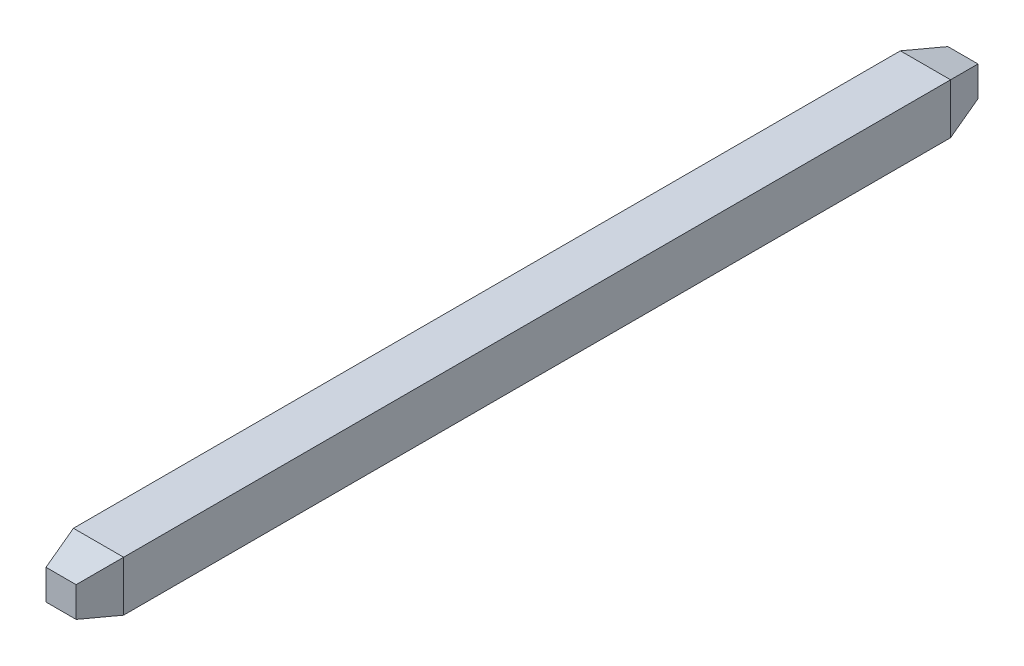
ISO-10303-21;
HEADER;
FILE_DESCRIPTION(('STEP AP214'),'2;1');
FILE_NAME('part.step','',(''),(''),'','','');
FILE_SCHEMA(('AUTOMOTIVE_DESIGN { 1 0 10303 214 1 1 1 1 }'));
ENDSEC;
DATA;
#1=APPLICATION_CONTEXT('core data for automotive mechanical design processes');
#2=APPLICATION_PROTOCOL_DEFINITION('international standard','automotive_design',2000,#1);
#3=PRODUCT_CONTEXT('',#1,'mechanical');
#4=PRODUCT('Part','Part','',(#3));
#5=PRODUCT_RELATED_PRODUCT_CATEGORY('part','',(#4));
#6=PRODUCT_DEFINITION_FORMATION('','',#4);
#7=PRODUCT_DEFINITION_CONTEXT('part definition',#1,'design');
#8=PRODUCT_DEFINITION('design','',#6,#7);
#9=PRODUCT_DEFINITION_SHAPE('','',#8);
#10=(LENGTH_UNIT() NAMED_UNIT(*) SI_UNIT(.MILLI.,.METRE.));
#11=(NAMED_UNIT(*) PLANE_ANGLE_UNIT() SI_UNIT($,.RADIAN.));
#12=(NAMED_UNIT(*) SI_UNIT($,.STERADIAN.) SOLID_ANGLE_UNIT());
#13=UNCERTAINTY_MEASURE_WITH_UNIT(LENGTH_MEASURE(1.E-05),#10,'distance_accuracy_value','');
#14=(GEOMETRIC_REPRESENTATION_CONTEXT(3) GLOBAL_UNCERTAINTY_ASSIGNED_CONTEXT((#13)) GLOBAL_UNIT_ASSIGNED_CONTEXT((#10,
#11,#12)) REPRESENTATION_CONTEXT('',''));
#15=CARTESIAN_POINT('',(0.,0.,0.));
#16=DIRECTION('',(0.,0.,1.));
#17=DIRECTION('',(1.,0.,0.));
#18=AXIS2_PLACEMENT_3D('',#15,#16,#17);
#19=CARTESIAN_POINT('',(3.54859499326237,-0.320000000000075,7.92229749663118));
#20=DIRECTION('',(0.,-0.965925826289069,0.25881904510252));
#21=DIRECTION('',(0.,-0.25881904510252,-0.965925826289069));
#22=AXIS2_PLACEMENT_3D('',#19,#20,#21);
#23=PLANE('',#22);
#24=DIRECTION('',(1.,0.,0.));
#25=VECTOR('',#24,1.);
#26=CARTESIAN_POINT('',(5.08,-0.192000000000075,8.4));
#27=LINE('',#26,#25);
#28=CARTESIAN_POINT('',(4.888,-0.192000000000074,8.4));
#29=VERTEX_POINT('',#28);
#30=CARTESIAN_POINT('',(5.272,-0.192000000000074,8.4));
#31=VERTEX_POINT('',#30);
#32=EDGE_CURVE('E20',#29,#31,#27,.T.);
#33=ORIENTED_EDGE('',*,*,#32,.F.);
#34=DIRECTION('',(0.250562807085731,0.25056280708573,0.93511312653103));
#35=VECTOR('',#34,1.);
#36=CARTESIAN_POINT('',(4.76,-0.320000000000075,7.92229749663118));
#37=LINE('',#36,#35);
#38=CARTESIAN_POINT('',(4.76,-0.320000000000075,7.92229749663118));
#39=VERTEX_POINT('',#38);
#40=EDGE_CURVE('E110',#39,#29,#37,.T.);
#41=ORIENTED_EDGE('',*,*,#40,.F.);
#42=DIRECTION('',(1.,0.,0.));
#43=VECTOR('',#42,1.);
#44=CARTESIAN_POINT('',(4.76,-0.320000000000075,7.92229749663118));
#45=LINE('',#44,#43);
#46=CARTESIAN_POINT('',(5.4,-0.320000000000074,7.92229749663118));
#47=VERTEX_POINT('',#46);
#48=EDGE_CURVE('E96',#47,#39,#45,.F.);
#49=ORIENTED_EDGE('',*,*,#48,.F.);
#50=DIRECTION('',(0.250562807085732,-0.250562807085729,-0.93511312653103));
#51=VECTOR('',#50,1.);
#52=CARTESIAN_POINT('',(5.272,-0.192000000000074,8.4));
#53=LINE('',#52,#51);
#54=EDGE_CURVE('E94',#31,#47,#53,.T.);
#55=ORIENTED_EDGE('',*,*,#54,.F.);
#56=EDGE_LOOP('',(#33,#41,#49,#55));
#57=FACE_BOUND('',#56,.T.);
#58=ADVANCED_FACE('F17',(#57),#23,.T.);
#59=CARTESIAN_POINT('',(3.54859499326237,-0.320000000000075,-2.62229749663118));
#60=DIRECTION('',(0.,0.965925826289068,0.258819045102521));
#61=DIRECTION('',(0.,-0.258819045102521,0.965925826289068));
#62=AXIS2_PLACEMENT_3D('',#59,#60,#61);
#63=PLANE('',#62);
#64=DIRECTION('',(0.250562807085732,0.25056280708573,-0.93511312653103));
#65=VECTOR('',#64,1.);
#66=CARTESIAN_POINT('',(4.76,-0.320000000000075,-2.62229749663118));
#67=LINE('',#66,#65);
#68=CARTESIAN_POINT('',(4.76,-0.320000000000075,-2.62229749663118));
#69=VERTEX_POINT('',#68);
#70=CARTESIAN_POINT('',(4.888,-0.192000000000074,-3.1));
#71=VERTEX_POINT('',#70);
#72=EDGE_CURVE('E113',#69,#71,#67,.T.);
#73=ORIENTED_EDGE('',*,*,#72,.T.);
#74=DIRECTION('',(1.,0.,0.));
#75=VECTOR('',#74,1.);
#76=CARTESIAN_POINT('',(5.08,-0.192000000000075,-3.1));
#77=LINE('',#76,#75);
#78=CARTESIAN_POINT('',(5.272,-0.192000000000074,-3.1));
#79=VERTEX_POINT('',#78);
#80=EDGE_CURVE('E79',#71,#79,#77,.T.);
#81=ORIENTED_EDGE('',*,*,#80,.T.);
#82=DIRECTION('',(0.250562807085734,-0.250562807085729,0.935113126531029));
#83=VECTOR('',#82,1.);
#84=CARTESIAN_POINT('',(5.272,-0.192000000000074,-3.1));
#85=LINE('',#84,#83);
#86=CARTESIAN_POINT('',(5.4,-0.320000000000074,-2.62229749663118));
#87=VERTEX_POINT('',#86);
#88=EDGE_CURVE('E108',#79,#87,#85,.T.);
#89=ORIENTED_EDGE('',*,*,#88,.T.);
#90=DIRECTION('',(1.,0.,0.));
#91=VECTOR('',#90,1.);
#92=CARTESIAN_POINT('',(4.76,-0.320000000000075,-2.62229749663118));
#93=LINE('',#92,#91);
#94=EDGE_CURVE('E118',#69,#87,#93,.T.);
#95=ORIENTED_EDGE('',*,*,#94,.F.);
#96=EDGE_LOOP('',(#73,#81,#89,#95));
#97=FACE_BOUND('',#96,.T.);
#98=ADVANCED_FACE('F281',(#97),#63,.F.);
#99=CARTESIAN_POINT('',(5.08,0.,8.4));
#100=DIRECTION('',(0.,0.,1.));
#101=DIRECTION('',(1.,0.,0.));
#102=AXIS2_PLACEMENT_3D('',#99,#100,#101);
#103=PLANE('',#102);
#104=ORIENTED_EDGE('',*,*,#32,.T.);
#105=DIRECTION('',(0.,1.,0.));
#106=VECTOR('',#105,1.);
#107=CARTESIAN_POINT('',(5.272,-1.5314050067377,8.4));
#108=LINE('',#107,#106);
#109=CARTESIAN_POINT('',(5.272,0.191999999999926,8.4));
#110=VERTEX_POINT('',#109);
#111=EDGE_CURVE('E88',#110,#31,#108,.F.);
#112=ORIENTED_EDGE('',*,*,#111,.F.);
#113=DIRECTION('',(1.,0.,0.));
#114=VECTOR('',#113,1.);
#115=CARTESIAN_POINT('',(6.61140500673763,0.191999999999924,8.4));
#116=LINE('',#115,#114);
#117=CARTESIAN_POINT('',(4.888,0.191999999999925,8.4));
#118=VERTEX_POINT('',#117);
#119=EDGE_CURVE('E124',#118,#110,#116,.T.);
#120=ORIENTED_EDGE('',*,*,#119,.F.);
#121=DIRECTION('',(0.,1.,0.));
#122=VECTOR('',#121,1.);
#123=CARTESIAN_POINT('',(4.888,1.53140500673756,8.4));
#124=LINE('',#123,#122);
#125=EDGE_CURVE('E90',#29,#118,#124,.T.);
#126=ORIENTED_EDGE('',*,*,#125,.F.);
#127=EDGE_LOOP('',(#104,#112,#120,#126));
#128=FACE_BOUND('',#127,.T.);
#129=ADVANCED_FACE('F85',(#128),#103,.T.);
#130=CARTESIAN_POINT('',(5.4,-1.5314050067377,7.92229749663118));
#131=DIRECTION('',(0.965925826289069,0.,0.25881904510252));
#132=DIRECTION('',(0.25881904510252,0.,-0.965925826289069));
#133=AXIS2_PLACEMENT_3D('',#130,#131,#132);
#134=PLANE('',#133);
#135=ORIENTED_EDGE('',*,*,#111,.T.);
#136=ORIENTED_EDGE('',*,*,#54,.T.);
#137=DIRECTION('',(0.,1.,0.));
#138=VECTOR('',#137,1.);
#139=CARTESIAN_POINT('',(5.4,-0.320000000000074,7.92229749663118));
#140=LINE('',#139,#138);
#141=CARTESIAN_POINT('',(5.4,0.319999999999925,7.92229749663118));
#142=VERTEX_POINT('',#141);
#143=EDGE_CURVE('E127',#142,#47,#140,.F.);
#144=ORIENTED_EDGE('',*,*,#143,.F.);
#145=DIRECTION('',(0.250562807085729,0.250562807085731,-0.93511312653103));
#146=VECTOR('',#145,1.);
#147=CARTESIAN_POINT('',(5.272,0.191999999999925,8.4));
#148=LINE('',#147,#146);
#149=EDGE_CURVE('E102',#110,#142,#148,.T.);
#150=ORIENTED_EDGE('',*,*,#149,.F.);
#151=EDGE_LOOP('',(#135,#136,#144,#150));
#152=FACE_BOUND('',#151,.T.);
#153=ADVANCED_FACE('F100',(#152),#134,.T.);
#154=CARTESIAN_POINT('',(5.08,0.,-3.1));
#155=DIRECTION('',(0.,0.,1.));
#156=DIRECTION('',(1.,0.,0.));
#157=AXIS2_PLACEMENT_3D('',#154,#155,#156);
#158=PLANE('',#157);
#159=DIRECTION('',(0.,1.,0.));
#160=VECTOR('',#159,1.);
#161=CARTESIAN_POINT('',(5.272,-1.5314050067377,-3.1));
#162=LINE('',#161,#160);
#163=CARTESIAN_POINT('',(5.272,0.191999999999926,-3.1));
#164=VERTEX_POINT('',#163);
#165=EDGE_CURVE('E106',#164,#79,#162,.F.);
#166=ORIENTED_EDGE('',*,*,#165,.T.);
#167=ORIENTED_EDGE('',*,*,#80,.F.);
#168=DIRECTION('',(0.,1.,0.));
#169=VECTOR('',#168,1.);
#170=CARTESIAN_POINT('',(4.888,1.53140500673756,-3.1));
#171=LINE('',#170,#169);
#172=CARTESIAN_POINT('',(4.888,0.191999999999925,-3.1));
#173=VERTEX_POINT('',#172);
#174=EDGE_CURVE('E115',#71,#173,#171,.T.);
#175=ORIENTED_EDGE('',*,*,#174,.T.);
#176=DIRECTION('',(1.,0.,0.));
#177=VECTOR('',#176,1.);
#178=CARTESIAN_POINT('',(6.61140500673763,0.191999999999924,-3.1));
#179=LINE('',#178,#177);
#180=EDGE_CURVE('E138',#173,#164,#179,.T.);
#181=ORIENTED_EDGE('',*,*,#180,.T.);
#182=EDGE_LOOP('',(#166,#167,#175,#181));
#183=FACE_BOUND('',#182,.T.);
#184=ADVANCED_FACE('F257',(#183),#158,.F.);
#185=CARTESIAN_POINT('',(5.4,-1.5314050067377,-2.62229749663118));
#186=DIRECTION('',(-0.965925826289068,0.,0.258819045102521));
#187=DIRECTION('',(0.258819045102521,0.,0.965925826289068));
#188=AXIS2_PLACEMENT_3D('',#185,#186,#187);
#189=PLANE('',#188);
#190=ORIENTED_EDGE('',*,*,#88,.F.);
#191=ORIENTED_EDGE('',*,*,#165,.F.);
#192=DIRECTION('',(0.250562807085729,0.250562807085732,0.93511312653103));
#193=VECTOR('',#192,1.);
#194=CARTESIAN_POINT('',(5.272,0.191999999999924,-3.1));
#195=LINE('',#194,#193);
#196=CARTESIAN_POINT('',(5.4,0.319999999999925,-2.62229749663118));
#197=VERTEX_POINT('',#196);
#198=EDGE_CURVE('E140',#164,#197,#195,.T.);
#199=ORIENTED_EDGE('',*,*,#198,.T.);
#200=DIRECTION('',(0.,1.,0.));
#201=VECTOR('',#200,1.);
#202=CARTESIAN_POINT('',(5.4,-0.320000000000074,-2.62229749663118));
#203=LINE('',#202,#201);
#204=EDGE_CURVE('E133',#87,#197,#203,.T.);
#205=ORIENTED_EDGE('',*,*,#204,.F.);
#206=EDGE_LOOP('',(#190,#191,#199,#205));
#207=FACE_BOUND('',#206,.T.);
#208=ADVANCED_FACE('F249',(#207),#189,.F.);
#209=CARTESIAN_POINT('',(4.76,1.53140500673756,7.92229749663118));
#210=DIRECTION('',(-0.965925826289069,0.,0.25881904510252));
#211=DIRECTION('',(0.25881904510252,0.,0.965925826289069));
#212=AXIS2_PLACEMENT_3D('',#209,#210,#211);
#213=PLANE('',#212);
#214=ORIENTED_EDGE('',*,*,#125,.T.);
#215=DIRECTION('',(0.25056280708573,-0.250562807085731,0.93511312653103));
#216=VECTOR('',#215,1.);
#217=CARTESIAN_POINT('',(4.76,0.319999999999926,7.92229749663118));
#218=LINE('',#217,#216);
#219=CARTESIAN_POINT('',(4.76,0.319999999999925,7.92229749663118));
#220=VERTEX_POINT('',#219);
#221=EDGE_CURVE('E121',#220,#118,#218,.T.);
#222=ORIENTED_EDGE('',*,*,#221,.F.);
#223=DIRECTION('',(0.,-1.,0.));
#224=VECTOR('',#223,1.);
#225=CARTESIAN_POINT('',(4.76,0.319999999999926,7.92229749663118));
#226=LINE('',#225,#224);
#227=EDGE_CURVE('E142',#39,#220,#226,.F.);
#228=ORIENTED_EDGE('',*,*,#227,.F.);
#229=ORIENTED_EDGE('',*,*,#40,.T.);
#230=EDGE_LOOP('',(#214,#222,#228,#229));
#231=FACE_BOUND('',#230,.T.);
#232=ADVANCED_FACE('F171',(#231),#213,.T.);
#233=CARTESIAN_POINT('',(4.76,1.53140500673756,-2.62229749663118));
#234=DIRECTION('',(0.965925826289068,0.,0.258819045102521));
#235=DIRECTION('',(0.258819045102521,0.,-0.965925826289068));
#236=AXIS2_PLACEMENT_3D('',#233,#234,#235);
#237=PLANE('',#236);
#238=DIRECTION('',(0.25056280708573,-0.250562807085732,-0.93511312653103));
#239=VECTOR('',#238,1.);
#240=CARTESIAN_POINT('',(4.76,0.319999999999926,-2.62229749663118));
#241=LINE('',#240,#239);
#242=CARTESIAN_POINT('',(4.76,0.319999999999926,-2.62229749663118));
#243=VERTEX_POINT('',#242);
#244=EDGE_CURVE('E136',#243,#173,#241,.T.);
#245=ORIENTED_EDGE('',*,*,#244,.T.);
#246=ORIENTED_EDGE('',*,*,#174,.F.);
#247=ORIENTED_EDGE('',*,*,#72,.F.);
#248=DIRECTION('',(0.,-1.,0.));
#249=VECTOR('',#248,1.);
#250=CARTESIAN_POINT('',(4.76,0.319999999999926,-2.62229749663118));
#251=LINE('',#250,#249);
#252=EDGE_CURVE('E35',#243,#69,#251,.T.);
#253=ORIENTED_EDGE('',*,*,#252,.F.);
#254=EDGE_LOOP('',(#245,#246,#247,#253));
#255=FACE_BOUND('',#254,.T.);
#256=ADVANCED_FACE('F188',(#255),#237,.F.);
#257=CARTESIAN_POINT('',(4.76,-0.320000000000075,-3.1));
#258=DIRECTION('',(0.,-1.,0.));
#259=DIRECTION('',(1.,0.,0.));
#260=AXIS2_PLACEMENT_3D('',#257,#258,#259);
#261=PLANE('',#260);
#262=ORIENTED_EDGE('',*,*,#94,.T.);
#263=DIRECTION('',(0.,0.,1.));
#264=VECTOR('',#263,1.);
#265=CARTESIAN_POINT('',(5.4,-0.320000000000074,-3.1));
#266=LINE('',#265,#264);
#267=EDGE_CURVE('E130',#47,#87,#266,.F.);
#268=ORIENTED_EDGE('',*,*,#267,.F.);
#269=ORIENTED_EDGE('',*,*,#48,.T.);
#270=DIRECTION('',(0.,0.,1.));
#271=VECTOR('',#270,1.);
#272=CARTESIAN_POINT('',(4.76,-0.320000000000075,-3.1));
#273=LINE('',#272,#271);
#274=EDGE_CURVE('E146',#69,#39,#273,.T.);
#275=ORIENTED_EDGE('',*,*,#274,.F.);
#276=EDGE_LOOP('',(#262,#268,#269,#275));
#277=FACE_BOUND('',#276,.T.);
#278=ADVANCED_FACE('F174',(#277),#261,.T.);
#279=CARTESIAN_POINT('',(6.61140500673763,0.319999999999925,7.92229749663118));
#280=DIRECTION('',(0.,0.965925826289069,0.25881904510252));
#281=DIRECTION('',(0.,-0.25881904510252,0.965925826289069));
#282=AXIS2_PLACEMENT_3D('',#279,#280,#281);
#283=PLANE('',#282);
#284=ORIENTED_EDGE('',*,*,#119,.T.);
#285=ORIENTED_EDGE('',*,*,#149,.T.);
#286=DIRECTION('',(-1.,0.,0.));
#287=VECTOR('',#286,1.);
#288=CARTESIAN_POINT('',(5.4,0.319999999999925,7.92229749663118));
#289=LINE('',#288,#287);
#290=EDGE_CURVE('E149',#220,#142,#289,.F.);
#291=ORIENTED_EDGE('',*,*,#290,.F.);
#292=ORIENTED_EDGE('',*,*,#221,.T.);
#293=EDGE_LOOP('',(#284,#285,#291,#292));
#294=FACE_BOUND('',#293,.T.);
#295=ADVANCED_FACE('F179',(#294),#283,.T.);
#296=CARTESIAN_POINT('',(5.4,-0.320000000000074,-3.1));
#297=DIRECTION('',(1.,0.,0.));
#298=DIRECTION('',(0.,1.,0.));
#299=AXIS2_PLACEMENT_3D('',#296,#297,#298);
#300=PLANE('',#299);
#301=ORIENTED_EDGE('',*,*,#204,.T.);
#302=DIRECTION('',(0.,0.,1.));
#303=VECTOR('',#302,1.);
#304=CARTESIAN_POINT('',(5.4,0.319999999999925,-3.1));
#305=LINE('',#304,#303);
#306=EDGE_CURVE('E152',#142,#197,#305,.F.);
#307=ORIENTED_EDGE('',*,*,#306,.F.);
#308=ORIENTED_EDGE('',*,*,#143,.T.);
#309=ORIENTED_EDGE('',*,*,#267,.T.);
#310=EDGE_LOOP('',(#301,#307,#308,#309));
#311=FACE_BOUND('',#310,.T.);
#312=ADVANCED_FACE('F177',(#311),#300,.T.);
#313=CARTESIAN_POINT('',(6.61140500673763,0.319999999999925,-2.62229749663118));
#314=DIRECTION('',(0.,-0.965925826289068,0.258819045102521));
#315=DIRECTION('',(0.,-0.258819045102521,-0.965925826289068));
#316=AXIS2_PLACEMENT_3D('',#313,#314,#315);
#317=PLANE('',#316);
#318=ORIENTED_EDGE('',*,*,#198,.F.);
#319=ORIENTED_EDGE('',*,*,#180,.F.);
#320=ORIENTED_EDGE('',*,*,#244,.F.);
#321=DIRECTION('',(-1.,0.,0.));
#322=VECTOR('',#321,1.);
#323=CARTESIAN_POINT('',(5.4,0.319999999999925,-2.62229749663118));
#324=LINE('',#323,#322);
#325=EDGE_CURVE('E26',#197,#243,#324,.T.);
#326=ORIENTED_EDGE('',*,*,#325,.F.);
#327=EDGE_LOOP('',(#318,#319,#320,#326));
#328=FACE_BOUND('',#327,.T.);
#329=ADVANCED_FACE('F163',(#328),#317,.F.);
#330=CARTESIAN_POINT('',(4.76,0.319999999999926,-3.1));
#331=DIRECTION('',(-1.,0.,0.));
#332=DIRECTION('',(0.,-1.,0.));
#333=AXIS2_PLACEMENT_3D('',#330,#331,#332);
#334=PLANE('',#333);
#335=ORIENTED_EDGE('',*,*,#252,.T.);
#336=ORIENTED_EDGE('',*,*,#274,.T.);
#337=ORIENTED_EDGE('',*,*,#227,.T.);
#338=DIRECTION('',(0.,0.,1.));
#339=VECTOR('',#338,1.);
#340=CARTESIAN_POINT('',(4.76,0.319999999999925,-3.1));
#341=LINE('',#340,#339);
#342=EDGE_CURVE('E11',#243,#220,#341,.T.);
#343=ORIENTED_EDGE('',*,*,#342,.F.);
#344=EDGE_LOOP('',(#335,#336,#337,#343));
#345=FACE_BOUND('',#344,.T.);
#346=ADVANCED_FACE('F167',(#345),#334,.T.);
#347=CARTESIAN_POINT('',(5.4,0.319999999999925,-3.1));
#348=DIRECTION('',(0.,1.,0.));
#349=DIRECTION('',(-1.,0.,0.));
#350=AXIS2_PLACEMENT_3D('',#347,#348,#349);
#351=PLANE('',#350);
#352=ORIENTED_EDGE('',*,*,#325,.T.);
#353=ORIENTED_EDGE('',*,*,#342,.T.);
#354=ORIENTED_EDGE('',*,*,#290,.T.);
#355=ORIENTED_EDGE('',*,*,#306,.T.);
#356=EDGE_LOOP('',(#352,#353,#354,#355));
#357=FACE_BOUND('',#356,.T.);
#358=ADVANCED_FACE('F158',(#357),#351,.T.);
#359=CLOSED_SHELL('',(#58,#98,#129,#153,#184,#208,#232,#256,#278,#295,#312,#329,#346,#358));
#360=MANIFOLD_SOLID_BREP('B1',#359);
#361=ADVANCED_BREP_SHAPE_REPRESENTATION('',(#18,#360),#14);
#362=SHAPE_DEFINITION_REPRESENTATION(#9,#361);
ENDSEC;
END-ISO-10303-21;
